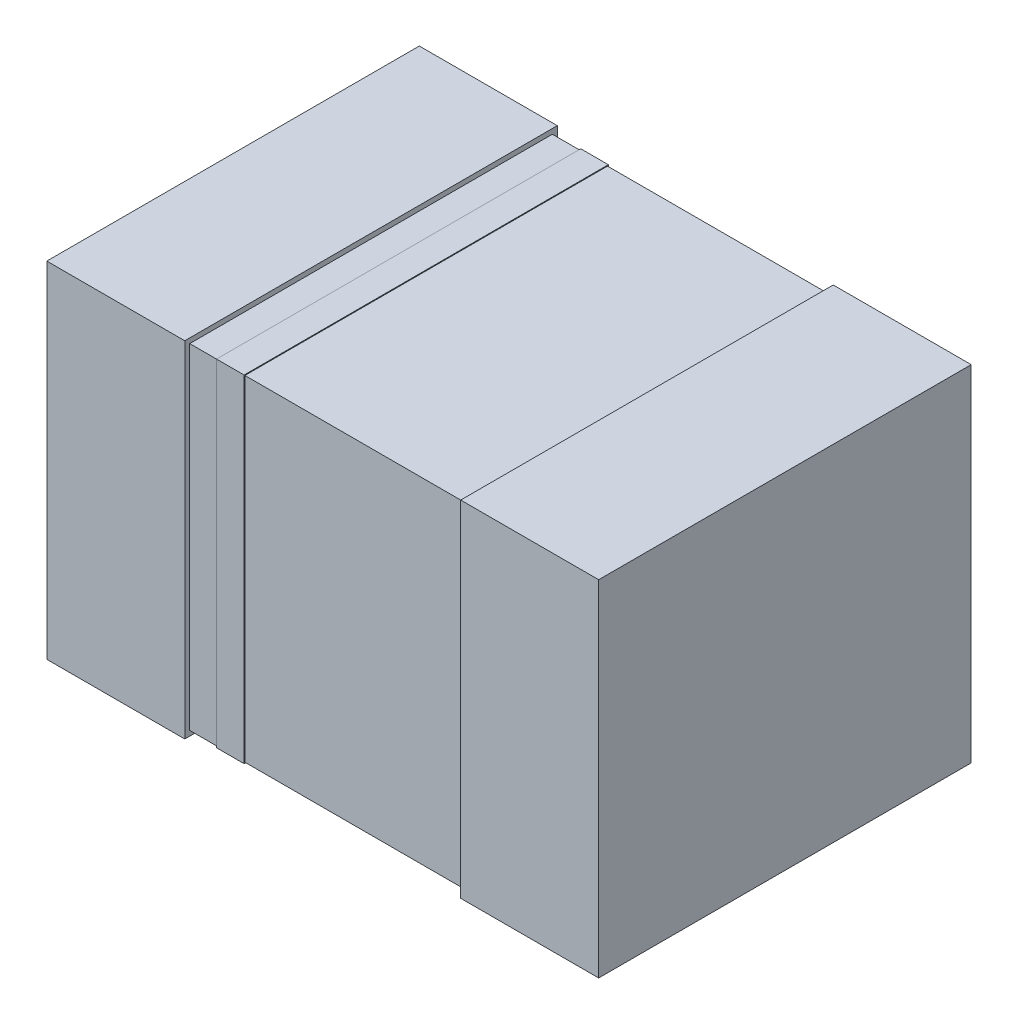
ISO-10303-21;
HEADER;
FILE_DESCRIPTION(('STEP AP214'),'2;1');
FILE_NAME('part.step','',(''),(''),'','','');
FILE_SCHEMA(('AUTOMOTIVE_DESIGN { 1 0 10303 214 1 1 1 1 }'));
ENDSEC;
DATA;
#1=APPLICATION_CONTEXT('core data for automotive mechanical design processes');
#2=APPLICATION_PROTOCOL_DEFINITION('international standard','automotive_design',2000,#1);
#3=PRODUCT_CONTEXT('',#1,'mechanical');
#4=PRODUCT('Part','Part','',(#3));
#5=PRODUCT_RELATED_PRODUCT_CATEGORY('part','',(#4));
#6=PRODUCT_DEFINITION_FORMATION('','',#4);
#7=PRODUCT_DEFINITION_CONTEXT('part definition',#1,'design');
#8=PRODUCT_DEFINITION('design','',#6,#7);
#9=PRODUCT_DEFINITION_SHAPE('','',#8);
#10=(LENGTH_UNIT() NAMED_UNIT(*) SI_UNIT(.MILLI.,.METRE.));
#11=(NAMED_UNIT(*) PLANE_ANGLE_UNIT() SI_UNIT($,.RADIAN.));
#12=(NAMED_UNIT(*) SI_UNIT($,.STERADIAN.) SOLID_ANGLE_UNIT());
#13=UNCERTAINTY_MEASURE_WITH_UNIT(LENGTH_MEASURE(1.E-05),#10,'distance_accuracy_value','');
#14=(GEOMETRIC_REPRESENTATION_CONTEXT(3) GLOBAL_UNCERTAINTY_ASSIGNED_CONTEXT((#13)) GLOBAL_UNIT_ASSIGNED_CONTEXT((#10,
#11,#12)) REPRESENTATION_CONTEXT('',''));
#15=CARTESIAN_POINT('',(0.,0.,0.));
#16=DIRECTION('',(0.,0.,1.));
#17=DIRECTION('',(1.,0.,0.));
#18=AXIS2_PLACEMENT_3D('',#15,#16,#17);
#19=CARTESIAN_POINT('',(-0.3,0.61,0.015));
#20=DIRECTION('',(0.,1.,0.));
#21=DIRECTION('',(0.,0.,1.));
#22=AXIS2_PLACEMENT_3D('',#19,#20,#21);
#23=PLANE('',#22);
#24=DIRECTION('',(1.,0.,0.));
#25=VECTOR('',#24,1.);
#26=CARTESIAN_POINT('',(-0.3,0.61,1.335));
#27=LINE('',#26,#25);
#28=CARTESIAN_POINT('',(-0.4,0.61,1.335));
#29=VERTEX_POINT('',#28);
#30=CARTESIAN_POINT('',(-0.3,0.61,1.335));
#31=VERTEX_POINT('',#30);
#32=EDGE_CURVE('P0_E126',#29,#31,#27,.T.);
#33=ORIENTED_EDGE('',*,*,#32,.T.);
#34=DIRECTION('',(0.,0.,-1.));
#35=VECTOR('',#34,1.);
#36=CARTESIAN_POINT('',(-0.3,0.61,0.015));
#37=LINE('',#36,#35);
#38=CARTESIAN_POINT('',(-0.3,0.61,0.015));
#39=VERTEX_POINT('',#38);
#40=EDGE_CURVE('P0_E119',#39,#31,#37,.F.);
#41=ORIENTED_EDGE('',*,*,#40,.F.);
#42=DIRECTION('',(1.,0.,0.));
#43=VECTOR('',#42,1.);
#44=CARTESIAN_POINT('',(-0.3,0.61,0.015));
#45=LINE('',#44,#43);
#46=CARTESIAN_POINT('',(-0.4,0.61,0.015));
#47=VERTEX_POINT('',#46);
#48=EDGE_CURVE('P0_E20',#39,#47,#45,.F.);
#49=ORIENTED_EDGE('',*,*,#48,.T.);
#50=DIRECTION('',(0.,0.,1.));
#51=VECTOR('',#50,1.);
#52=CARTESIAN_POINT('',(-0.4,0.61,0.015));
#53=LINE('',#52,#51);
#54=EDGE_CURVE('P0_E122',#29,#47,#53,.F.);
#55=ORIENTED_EDGE('',*,*,#54,.F.);
#56=EDGE_LOOP('',(#33,#41,#49,#55));
#57=FACE_BOUND('',#56,.T.);
#58=ADVANCED_FACE('P0_F17',(#57),#23,.T.);
#59=CARTESIAN_POINT('',(-0.4,0.607,0.018));
#60=DIRECTION('',(0.,-1.,0.));
#61=DIRECTION('',(0.,0.,-1.));
#62=AXIS2_PLACEMENT_3D('',#59,#60,#61);
#63=PLANE('',#62);
#64=DIRECTION('',(-1.,0.,0.));
#65=VECTOR('',#64,1.);
#66=CARTESIAN_POINT('',(-0.3,0.607,1.332));
#67=LINE('',#66,#65);
#68=CARTESIAN_POINT('',(-0.4,0.607,1.332));
#69=VERTEX_POINT('',#68);
#70=CARTESIAN_POINT('',(-0.3,0.607,1.332));
#71=VERTEX_POINT('',#70);
#72=EDGE_CURVE('P0_E106',#69,#71,#67,.F.);
#73=ORIENTED_EDGE('',*,*,#72,.F.);
#74=DIRECTION('',(0.,0.,1.));
#75=VECTOR('',#74,1.);
#76=CARTESIAN_POINT('',(-0.4,0.607,0.015));
#77=LINE('',#76,#75);
#78=CARTESIAN_POINT('',(-0.4,0.607,0.018));
#79=VERTEX_POINT('',#78);
#80=EDGE_CURVE('P0_E90',#79,#69,#77,.T.);
#81=ORIENTED_EDGE('',*,*,#80,.F.);
#82=DIRECTION('',(1.,0.,0.));
#83=VECTOR('',#82,1.);
#84=CARTESIAN_POINT('',(-0.4,0.607,0.018));
#85=LINE('',#84,#83);
#86=CARTESIAN_POINT('',(-0.3,0.607,0.018));
#87=VERTEX_POINT('',#86);
#88=EDGE_CURVE('P0_E79',#87,#79,#85,.F.);
#89=ORIENTED_EDGE('',*,*,#88,.F.);
#90=DIRECTION('',(0.,0.,-1.));
#91=VECTOR('',#90,1.);
#92=CARTESIAN_POINT('',(-0.3,0.607,0.015));
#93=LINE('',#92,#91);
#94=EDGE_CURVE('P0_E116',#71,#87,#93,.T.);
#95=ORIENTED_EDGE('',*,*,#94,.F.);
#96=EDGE_LOOP('',(#73,#81,#89,#95));
#97=FACE_BOUND('',#96,.T.);
#98=ADVANCED_FACE('P0_F223',(#97),#63,.T.);
#99=CARTESIAN_POINT('',(-0.4,-0.607,0.018));
#100=DIRECTION('',(0.,0.,1.));
#101=DIRECTION('',(1.,0.,0.));
#102=AXIS2_PLACEMENT_3D('',#99,#100,#101);
#103=PLANE('',#102);
#104=ORIENTED_EDGE('',*,*,#88,.T.);
#105=DIRECTION('',(0.,1.,0.));
#106=VECTOR('',#105,1.);
#107=CARTESIAN_POINT('',(-0.4,0.61,0.018));
#108=LINE('',#107,#106);
#109=CARTESIAN_POINT('',(-0.4,-0.607,0.018));
#110=VERTEX_POINT('',#109);
#111=EDGE_CURVE('P0_E82',#110,#79,#108,.T.);
#112=ORIENTED_EDGE('',*,*,#111,.F.);
#113=DIRECTION('',(1.,0.,0.));
#114=VECTOR('',#113,1.);
#115=CARTESIAN_POINT('',(-0.3,-0.607,0.018));
#116=LINE('',#115,#114);
#117=CARTESIAN_POINT('',(-0.3,-0.607,0.018));
#118=VERTEX_POINT('',#117);
#119=EDGE_CURVE('P0_E86',#118,#110,#116,.F.);
#120=ORIENTED_EDGE('',*,*,#119,.F.);
#121=DIRECTION('',(0.,1.,0.));
#122=VECTOR('',#121,1.);
#123=CARTESIAN_POINT('',(-0.3,-0.61,0.018));
#124=LINE('',#123,#122);
#125=EDGE_CURVE('P0_E111',#87,#118,#124,.F.);
#126=ORIENTED_EDGE('',*,*,#125,.F.);
#127=EDGE_LOOP('',(#104,#112,#120,#126));
#128=FACE_BOUND('',#127,.T.);
#129=ADVANCED_FACE('P0_F84',(#128),#103,.T.);
#130=CARTESIAN_POINT('',(-0.3,-0.607,1.332));
#131=DIRECTION('',(0.,0.,-1.));
#132=DIRECTION('',(-1.,0.,0.));
#133=AXIS2_PLACEMENT_3D('',#130,#131,#132);
#134=PLANE('',#133);
#135=ORIENTED_EDGE('',*,*,#72,.T.);
#136=DIRECTION('',(0.,1.,0.));
#137=VECTOR('',#136,1.);
#138=CARTESIAN_POINT('',(-0.3,-0.61,1.332));
#139=LINE('',#138,#137);
#140=CARTESIAN_POINT('',(-0.3,-0.607,1.332));
#141=VERTEX_POINT('',#140);
#142=EDGE_CURVE('P0_E139',#141,#71,#139,.T.);
#143=ORIENTED_EDGE('',*,*,#142,.F.);
#144=DIRECTION('',(1.,0.,0.));
#145=VECTOR('',#144,1.);
#146=CARTESIAN_POINT('',(-0.3,-0.607,1.332));
#147=LINE('',#146,#145);
#148=CARTESIAN_POINT('',(-0.4,-0.607,1.332));
#149=VERTEX_POINT('',#148);
#150=EDGE_CURVE('P0_E105',#149,#141,#147,.T.);
#151=ORIENTED_EDGE('',*,*,#150,.F.);
#152=DIRECTION('',(0.,1.,0.));
#153=VECTOR('',#152,1.);
#154=CARTESIAN_POINT('',(-0.4,-0.607,1.332));
#155=LINE('',#154,#153);
#156=EDGE_CURVE('P0_E97',#69,#149,#155,.F.);
#157=ORIENTED_EDGE('',*,*,#156,.F.);
#158=EDGE_LOOP('',(#135,#143,#151,#157));
#159=FACE_BOUND('',#158,.T.);
#160=ADVANCED_FACE('P0_F205',(#159),#134,.T.);
#161=CARTESIAN_POINT('',(-0.3,-0.607,0.018));
#162=DIRECTION('',(0.,1.,0.));
#163=DIRECTION('',(0.,0.,1.));
#164=AXIS2_PLACEMENT_3D('',#161,#162,#163);
#165=PLANE('',#164);
#166=ORIENTED_EDGE('',*,*,#150,.T.);
#167=DIRECTION('',(0.,0.,-1.));
#168=VECTOR('',#167,1.);
#169=CARTESIAN_POINT('',(-0.3,-0.607,0.015));
#170=LINE('',#169,#168);
#171=EDGE_CURVE('P0_E104',#118,#141,#170,.F.);
#172=ORIENTED_EDGE('',*,*,#171,.F.);
#173=ORIENTED_EDGE('',*,*,#119,.T.);
#174=DIRECTION('',(0.,0.,1.));
#175=VECTOR('',#174,1.);
#176=CARTESIAN_POINT('',(-0.4,-0.607,0.018));
#177=LINE('',#176,#175);
#178=EDGE_CURVE('P0_E94',#149,#110,#177,.F.);
#179=ORIENTED_EDGE('',*,*,#178,.F.);
#180=EDGE_LOOP('',(#166,#172,#173,#179));
#181=FACE_BOUND('',#180,.T.);
#182=ADVANCED_FACE('P0_F102',(#181),#165,.T.);
#183=CARTESIAN_POINT('',(-0.4,0.61,0.015));
#184=DIRECTION('',(0.,0.,-1.));
#185=DIRECTION('',(-1.,0.,0.));
#186=AXIS2_PLACEMENT_3D('',#183,#184,#185);
#187=PLANE('',#186);
#188=DIRECTION('',(1.,0.,0.));
#189=VECTOR('',#188,1.);
#190=CARTESIAN_POINT('',(-0.4,-0.61,0.015));
#191=LINE('',#190,#189);
#192=CARTESIAN_POINT('',(-0.4,-0.61,0.015));
#193=VERTEX_POINT('',#192);
#194=CARTESIAN_POINT('',(-0.3,-0.61,0.015));
#195=VERTEX_POINT('',#194);
#196=EDGE_CURVE('P0_E99',#193,#195,#191,.T.);
#197=ORIENTED_EDGE('',*,*,#196,.F.);
#198=DIRECTION('',(0.,1.,0.));
#199=VECTOR('',#198,1.);
#200=CARTESIAN_POINT('',(-0.4,0.61,0.015));
#201=LINE('',#200,#199);
#202=EDGE_CURVE('P0_E134',#193,#47,#201,.T.);
#203=ORIENTED_EDGE('',*,*,#202,.T.);
#204=ORIENTED_EDGE('',*,*,#48,.F.);
#205=DIRECTION('',(0.,1.,0.));
#206=VECTOR('',#205,1.);
#207=CARTESIAN_POINT('',(-0.3,0.61,0.015));
#208=LINE('',#207,#206);
#209=EDGE_CURVE('P0_E108',#39,#195,#208,.F.);
#210=ORIENTED_EDGE('',*,*,#209,.T.);
#211=EDGE_LOOP('',(#197,#203,#204,#210));
#212=FACE_BOUND('',#211,.T.);
#213=ADVANCED_FACE('P0_F136',(#212),#187,.T.);
#214=CARTESIAN_POINT('',(-0.3,-0.61,0.015));
#215=DIRECTION('',(1.,0.,0.));
#216=DIRECTION('',(0.,0.,-1.));
#217=AXIS2_PLACEMENT_3D('',#214,#215,#216);
#218=PLANE('',#217);
#219=ORIENTED_EDGE('',*,*,#142,.T.);
#220=ORIENTED_EDGE('',*,*,#94,.T.);
#221=ORIENTED_EDGE('',*,*,#125,.T.);
#222=ORIENTED_EDGE('',*,*,#171,.T.);
#223=EDGE_LOOP('',(#219,#220,#221,#222));
#224=FACE_BOUND('',#223,.T.);
#225=DIRECTION('',(0.,1.,0.));
#226=VECTOR('',#225,1.);
#227=CARTESIAN_POINT('',(-0.3,-0.61,1.335));
#228=LINE('',#227,#226);
#229=CARTESIAN_POINT('',(-0.3,-0.61,1.335));
#230=VERTEX_POINT('',#229);
#231=EDGE_CURVE('P0_E144',#230,#31,#228,.T.);
#232=ORIENTED_EDGE('',*,*,#231,.F.);
#233=DIRECTION('',(0.,0.,-1.));
#234=VECTOR('',#233,1.);
#235=CARTESIAN_POINT('',(-0.3,-0.61,0.015));
#236=LINE('',#235,#234);
#237=EDGE_CURVE('P0_E149',#195,#230,#236,.F.);
#238=ORIENTED_EDGE('',*,*,#237,.F.);
#239=ORIENTED_EDGE('',*,*,#209,.F.);
#240=ORIENTED_EDGE('',*,*,#40,.T.);
#241=EDGE_LOOP('',(#232,#238,#239,#240));
#242=FACE_BOUND('',#241,.T.);
#243=ADVANCED_FACE('P0_F158',(#224,#242),#218,.T.);
#244=CARTESIAN_POINT('',(-0.4,-0.61,1.335));
#245=DIRECTION('',(0.,0.,1.));
#246=DIRECTION('',(1.,0.,0.));
#247=AXIS2_PLACEMENT_3D('',#244,#245,#246);
#248=PLANE('',#247);
#249=ORIENTED_EDGE('',*,*,#32,.F.);
#250=DIRECTION('',(0.,1.,0.));
#251=VECTOR('',#250,1.);
#252=CARTESIAN_POINT('',(-0.4,-0.607,1.335));
#253=LINE('',#252,#251);
#254=CARTESIAN_POINT('',(-0.4,-0.61,1.335));
#255=VERTEX_POINT('',#254);
#256=EDGE_CURVE('P0_E35',#255,#29,#253,.T.);
#257=ORIENTED_EDGE('',*,*,#256,.F.);
#258=DIRECTION('',(1.,0.,0.));
#259=VECTOR('',#258,1.);
#260=CARTESIAN_POINT('',(-0.4,-0.61,1.335));
#261=LINE('',#260,#259);
#262=EDGE_CURVE('P0_E26',#230,#255,#261,.F.);
#263=ORIENTED_EDGE('',*,*,#262,.F.);
#264=ORIENTED_EDGE('',*,*,#231,.T.);
#265=EDGE_LOOP('',(#249,#257,#263,#264));
#266=FACE_BOUND('',#265,.T.);
#267=ADVANCED_FACE('P0_F156',(#266),#248,.T.);
#268=CARTESIAN_POINT('',(-0.4,-0.607,0.018));
#269=DIRECTION('',(-1.,0.,0.));
#270=DIRECTION('',(0.,0.,1.));
#271=AXIS2_PLACEMENT_3D('',#268,#269,#270);
#272=PLANE('',#271);
#273=ORIENTED_EDGE('',*,*,#178,.T.);
#274=ORIENTED_EDGE('',*,*,#111,.T.);
#275=ORIENTED_EDGE('',*,*,#80,.T.);
#276=ORIENTED_EDGE('',*,*,#156,.T.);
#277=EDGE_LOOP('',(#273,#274,#275,#276));
#278=FACE_BOUND('',#277,.T.);
#279=ORIENTED_EDGE('',*,*,#202,.F.);
#280=DIRECTION('',(0.,0.,-1.));
#281=VECTOR('',#280,1.);
#282=CARTESIAN_POINT('',(-0.4,-0.61,0.015));
#283=LINE('',#282,#281);
#284=EDGE_CURVE('P0_E11',#255,#193,#283,.T.);
#285=ORIENTED_EDGE('',*,*,#284,.F.);
#286=ORIENTED_EDGE('',*,*,#256,.T.);
#287=ORIENTED_EDGE('',*,*,#54,.T.);
#288=EDGE_LOOP('',(#279,#285,#286,#287));
#289=FACE_BOUND('',#288,.T.);
#290=ADVANCED_FACE('P0_F95',(#278,#289),#272,.T.);
#291=CARTESIAN_POINT('',(-0.4,-0.61,0.015));
#292=DIRECTION('',(0.,-1.,0.));
#293=DIRECTION('',(0.,0.,-1.));
#294=AXIS2_PLACEMENT_3D('',#291,#292,#293);
#295=PLANE('',#294);
#296=ORIENTED_EDGE('',*,*,#262,.T.);
#297=ORIENTED_EDGE('',*,*,#284,.T.);
#298=ORIENTED_EDGE('',*,*,#196,.T.);
#299=ORIENTED_EDGE('',*,*,#237,.T.);
#300=EDGE_LOOP('',(#296,#297,#298,#299));
#301=FACE_BOUND('',#300,.T.);
#302=ADVANCED_FACE('P0_F154',(#301),#295,.T.);
#303=CLOSED_SHELL('',(#58,#98,#129,#160,#182,#213,#243,#267,#290,#302));
#304=MANIFOLD_SOLID_BREP('P0_B1',#303);
#305=CARTESIAN_POINT('',(0.5,0.625,0.));
#306=DIRECTION('',(-1.,0.,0.));
#307=DIRECTION('',(0.,0.,1.));
#308=AXIS2_PLACEMENT_3D('',#305,#306,#307);
#309=PLANE('',#308);
#310=DIRECTION('',(0.,1.,0.));
#311=VECTOR('',#310,1.);
#312=CARTESIAN_POINT('',(0.5,-0.625,1.35));
#313=LINE('',#312,#311);
#314=CARTESIAN_POINT('',(0.5,0.625,1.35));
#315=VERTEX_POINT('',#314);
#316=CARTESIAN_POINT('',(0.5,-0.625,1.35));
#317=VERTEX_POINT('',#316);
#318=EDGE_CURVE('P1_E68',#315,#317,#313,.F.);
#319=ORIENTED_EDGE('',*,*,#318,.F.);
#320=DIRECTION('',(0.,0.,1.));
#321=VECTOR('',#320,1.);
#322=CARTESIAN_POINT('',(0.5,0.625,0.));
#323=LINE('',#322,#321);
#324=CARTESIAN_POINT('',(0.5,0.625,0.));
#325=VERTEX_POINT('',#324);
#326=EDGE_CURVE('P1_E55',#325,#315,#323,.T.);
#327=ORIENTED_EDGE('',*,*,#326,.F.);
#328=DIRECTION('',(0.,1.,0.));
#329=VECTOR('',#328,1.);
#330=CARTESIAN_POINT('',(0.5,0.625,0.));
#331=LINE('',#330,#329);
#332=CARTESIAN_POINT('',(0.5,-0.625,0.));
#333=VERTEX_POINT('',#332);
#334=EDGE_CURVE('P1_E20',#333,#325,#331,.T.);
#335=ORIENTED_EDGE('',*,*,#334,.F.);
#336=DIRECTION('',(0.,0.,-1.));
#337=VECTOR('',#336,1.);
#338=CARTESIAN_POINT('',(0.5,-0.625,0.));
#339=LINE('',#338,#337);
#340=EDGE_CURVE('P1_E81',#317,#333,#339,.T.);
#341=ORIENTED_EDGE('',*,*,#340,.F.);
#342=EDGE_LOOP('',(#319,#327,#335,#341));
#343=FACE_BOUND('',#342,.T.);
#344=ADVANCED_FACE('P1_F17',(#343),#309,.T.);
#345=CARTESIAN_POINT('',(0.5,0.625,0.));
#346=DIRECTION('',(0.,0.,-1.));
#347=DIRECTION('',(-1.,0.,0.));
#348=AXIS2_PLACEMENT_3D('',#345,#346,#347);
#349=PLANE('',#348);
#350=DIRECTION('',(1.,0.,0.));
#351=VECTOR('',#350,1.);
#352=CARTESIAN_POINT('',(0.5,-0.625,0.));
#353=LINE('',#352,#351);
#354=CARTESIAN_POINT('',(1.,-0.625,0.));
#355=VERTEX_POINT('',#354);
#356=EDGE_CURVE('P1_E64',#333,#355,#353,.T.);
#357=ORIENTED_EDGE('',*,*,#356,.F.);
#358=ORIENTED_EDGE('',*,*,#334,.T.);
#359=DIRECTION('',(1.,0.,0.));
#360=VECTOR('',#359,1.);
#361=CARTESIAN_POINT('',(1.,0.625,0.));
#362=LINE('',#361,#360);
#363=CARTESIAN_POINT('',(1.,0.625,0.));
#364=VERTEX_POINT('',#363);
#365=EDGE_CURVE('P1_E61',#364,#325,#362,.F.);
#366=ORIENTED_EDGE('',*,*,#365,.F.);
#367=DIRECTION('',(0.,1.,0.));
#368=VECTOR('',#367,1.);
#369=CARTESIAN_POINT('',(1.,-0.625,0.));
#370=LINE('',#369,#368);
#371=EDGE_CURVE('P1_E83',#355,#364,#370,.T.);
#372=ORIENTED_EDGE('',*,*,#371,.F.);
#373=EDGE_LOOP('',(#357,#358,#366,#372));
#374=FACE_BOUND('',#373,.T.);
#375=ADVANCED_FACE('P1_F60',(#374),#349,.T.);
#376=CARTESIAN_POINT('',(1.,0.625,0.));
#377=DIRECTION('',(0.,1.,0.));
#378=DIRECTION('',(0.,0.,1.));
#379=AXIS2_PLACEMENT_3D('',#376,#377,#378);
#380=PLANE('',#379);
#381=DIRECTION('',(1.,0.,0.));
#382=VECTOR('',#381,1.);
#383=CARTESIAN_POINT('',(0.5,0.625,1.35));
#384=LINE('',#383,#382);
#385=CARTESIAN_POINT('',(1.,0.625,1.35));
#386=VERTEX_POINT('',#385);
#387=EDGE_CURVE('P1_E70',#386,#315,#384,.F.);
#388=ORIENTED_EDGE('',*,*,#387,.F.);
#389=DIRECTION('',(0.,0.,-1.));
#390=VECTOR('',#389,1.);
#391=CARTESIAN_POINT('',(1.,0.625,0.));
#392=LINE('',#391,#390);
#393=EDGE_CURVE('P1_E74',#364,#386,#392,.F.);
#394=ORIENTED_EDGE('',*,*,#393,.F.);
#395=ORIENTED_EDGE('',*,*,#365,.T.);
#396=ORIENTED_EDGE('',*,*,#326,.T.);
#397=EDGE_LOOP('',(#388,#394,#395,#396));
#398=FACE_BOUND('',#397,.T.);
#399=ADVANCED_FACE('P1_F72',(#398),#380,.T.);
#400=CARTESIAN_POINT('',(0.5,-0.625,1.35));
#401=DIRECTION('',(0.,0.,1.));
#402=DIRECTION('',(1.,0.,0.));
#403=AXIS2_PLACEMENT_3D('',#400,#401,#402);
#404=PLANE('',#403);
#405=ORIENTED_EDGE('',*,*,#387,.T.);
#406=ORIENTED_EDGE('',*,*,#318,.T.);
#407=DIRECTION('',(1.,0.,0.));
#408=VECTOR('',#407,1.);
#409=CARTESIAN_POINT('',(0.5,-0.625,1.35));
#410=LINE('',#409,#408);
#411=CARTESIAN_POINT('',(1.,-0.625,1.35));
#412=VERTEX_POINT('',#411);
#413=EDGE_CURVE('P1_E35',#412,#317,#410,.F.);
#414=ORIENTED_EDGE('',*,*,#413,.F.);
#415=DIRECTION('',(0.,1.,0.));
#416=VECTOR('',#415,1.);
#417=CARTESIAN_POINT('',(1.,-0.625,1.35));
#418=LINE('',#417,#416);
#419=EDGE_CURVE('P1_E26',#386,#412,#418,.F.);
#420=ORIENTED_EDGE('',*,*,#419,.F.);
#421=EDGE_LOOP('',(#405,#406,#414,#420));
#422=FACE_BOUND('',#421,.T.);
#423=ADVANCED_FACE('P1_F89',(#422),#404,.T.);
#424=CARTESIAN_POINT('',(0.5,-0.625,0.));
#425=DIRECTION('',(0.,-1.,0.));
#426=DIRECTION('',(0.,0.,-1.));
#427=AXIS2_PLACEMENT_3D('',#424,#425,#426);
#428=PLANE('',#427);
#429=ORIENTED_EDGE('',*,*,#413,.T.);
#430=ORIENTED_EDGE('',*,*,#340,.T.);
#431=ORIENTED_EDGE('',*,*,#356,.T.);
#432=DIRECTION('',(0.,0.,-1.));
#433=VECTOR('',#432,1.);
#434=CARTESIAN_POINT('',(1.,-0.625,0.));
#435=LINE('',#434,#433);
#436=EDGE_CURVE('P1_E11',#412,#355,#435,.T.);
#437=ORIENTED_EDGE('',*,*,#436,.F.);
#438=EDGE_LOOP('',(#429,#430,#431,#437));
#439=FACE_BOUND('',#438,.T.);
#440=ADVANCED_FACE('P1_F91',(#439),#428,.T.);
#441=CARTESIAN_POINT('',(1.,-0.625,0.));
#442=DIRECTION('',(1.,0.,0.));
#443=DIRECTION('',(0.,0.,-1.));
#444=AXIS2_PLACEMENT_3D('',#441,#442,#443);
#445=PLANE('',#444);
#446=ORIENTED_EDGE('',*,*,#419,.T.);
#447=ORIENTED_EDGE('',*,*,#436,.T.);
#448=ORIENTED_EDGE('',*,*,#371,.T.);
#449=ORIENTED_EDGE('',*,*,#393,.T.);
#450=EDGE_LOOP('',(#446,#447,#448,#449));
#451=FACE_BOUND('',#450,.T.);
#452=ADVANCED_FACE('P1_F88',(#451),#445,.T.);
#453=CLOSED_SHELL('',(#344,#375,#399,#423,#440,#452));
#454=MANIFOLD_SOLID_BREP('P1_B1',#453);
#455=CARTESIAN_POINT('',(-1.,0.625,0.));
#456=DIRECTION('',(-1.,0.,0.));
#457=DIRECTION('',(0.,0.,1.));
#458=AXIS2_PLACEMENT_3D('',#455,#456,#457);
#459=PLANE('',#458);
#460=DIRECTION('',(0.,1.,0.));
#461=VECTOR('',#460,1.);
#462=CARTESIAN_POINT('',(-1.,-0.625,1.35));
#463=LINE('',#462,#461);
#464=CARTESIAN_POINT('',(-1.,0.625,1.35));
#465=VERTEX_POINT('',#464);
#466=CARTESIAN_POINT('',(-1.,-0.625,1.35));
#467=VERTEX_POINT('',#466);
#468=EDGE_CURVE('P2_E68',#465,#467,#463,.F.);
#469=ORIENTED_EDGE('',*,*,#468,.F.);
#470=DIRECTION('',(0.,0.,1.));
#471=VECTOR('',#470,1.);
#472=CARTESIAN_POINT('',(-1.,0.625,0.));
#473=LINE('',#472,#471);
#474=CARTESIAN_POINT('',(-1.,0.625,0.));
#475=VERTEX_POINT('',#474);
#476=EDGE_CURVE('P2_E55',#475,#465,#473,.T.);
#477=ORIENTED_EDGE('',*,*,#476,.F.);
#478=DIRECTION('',(0.,1.,0.));
#479=VECTOR('',#478,1.);
#480=CARTESIAN_POINT('',(-1.,0.625,0.));
#481=LINE('',#480,#479);
#482=CARTESIAN_POINT('',(-1.,-0.625,0.));
#483=VERTEX_POINT('',#482);
#484=EDGE_CURVE('P2_E20',#483,#475,#481,.T.);
#485=ORIENTED_EDGE('',*,*,#484,.F.);
#486=DIRECTION('',(0.,0.,-1.));
#487=VECTOR('',#486,1.);
#488=CARTESIAN_POINT('',(-1.,-0.625,0.));
#489=LINE('',#488,#487);
#490=EDGE_CURVE('P2_E81',#467,#483,#489,.T.);
#491=ORIENTED_EDGE('',*,*,#490,.F.);
#492=EDGE_LOOP('',(#469,#477,#485,#491));
#493=FACE_BOUND('',#492,.T.);
#494=ADVANCED_FACE('P2_F17',(#493),#459,.T.);
#495=CARTESIAN_POINT('',(-1.,0.625,0.));
#496=DIRECTION('',(0.,0.,-1.));
#497=DIRECTION('',(-1.,0.,0.));
#498=AXIS2_PLACEMENT_3D('',#495,#496,#497);
#499=PLANE('',#498);
#500=DIRECTION('',(1.,0.,0.));
#501=VECTOR('',#500,1.);
#502=CARTESIAN_POINT('',(-1.,-0.625,0.));
#503=LINE('',#502,#501);
#504=CARTESIAN_POINT('',(-0.5,-0.625,0.));
#505=VERTEX_POINT('',#504);
#506=EDGE_CURVE('P2_E64',#483,#505,#503,.T.);
#507=ORIENTED_EDGE('',*,*,#506,.F.);
#508=ORIENTED_EDGE('',*,*,#484,.T.);
#509=DIRECTION('',(1.,0.,0.));
#510=VECTOR('',#509,1.);
#511=CARTESIAN_POINT('',(-0.5,0.625,0.));
#512=LINE('',#511,#510);
#513=CARTESIAN_POINT('',(-0.5,0.625,0.));
#514=VERTEX_POINT('',#513);
#515=EDGE_CURVE('P2_E61',#514,#475,#512,.F.);
#516=ORIENTED_EDGE('',*,*,#515,.F.);
#517=DIRECTION('',(0.,1.,0.));
#518=VECTOR('',#517,1.);
#519=CARTESIAN_POINT('',(-0.5,-0.625,0.));
#520=LINE('',#519,#518);
#521=EDGE_CURVE('P2_E83',#505,#514,#520,.T.);
#522=ORIENTED_EDGE('',*,*,#521,.F.);
#523=EDGE_LOOP('',(#507,#508,#516,#522));
#524=FACE_BOUND('',#523,.T.);
#525=ADVANCED_FACE('P2_F60',(#524),#499,.T.);
#526=CARTESIAN_POINT('',(-0.5,0.625,0.));
#527=DIRECTION('',(0.,1.,0.));
#528=DIRECTION('',(0.,0.,1.));
#529=AXIS2_PLACEMENT_3D('',#526,#527,#528);
#530=PLANE('',#529);
#531=DIRECTION('',(1.,0.,0.));
#532=VECTOR('',#531,1.);
#533=CARTESIAN_POINT('',(-1.,0.625,1.35));
#534=LINE('',#533,#532);
#535=CARTESIAN_POINT('',(-0.5,0.625,1.35));
#536=VERTEX_POINT('',#535);
#537=EDGE_CURVE('P2_E70',#536,#465,#534,.F.);
#538=ORIENTED_EDGE('',*,*,#537,.F.);
#539=DIRECTION('',(0.,0.,-1.));
#540=VECTOR('',#539,1.);
#541=CARTESIAN_POINT('',(-0.5,0.625,0.));
#542=LINE('',#541,#540);
#543=EDGE_CURVE('P2_E74',#514,#536,#542,.F.);
#544=ORIENTED_EDGE('',*,*,#543,.F.);
#545=ORIENTED_EDGE('',*,*,#515,.T.);
#546=ORIENTED_EDGE('',*,*,#476,.T.);
#547=EDGE_LOOP('',(#538,#544,#545,#546));
#548=FACE_BOUND('',#547,.T.);
#549=ADVANCED_FACE('P2_F72',(#548),#530,.T.);
#550=CARTESIAN_POINT('',(-1.,-0.625,1.35));
#551=DIRECTION('',(0.,0.,1.));
#552=DIRECTION('',(1.,0.,0.));
#553=AXIS2_PLACEMENT_3D('',#550,#551,#552);
#554=PLANE('',#553);
#555=ORIENTED_EDGE('',*,*,#537,.T.);
#556=ORIENTED_EDGE('',*,*,#468,.T.);
#557=DIRECTION('',(1.,0.,0.));
#558=VECTOR('',#557,1.);
#559=CARTESIAN_POINT('',(-1.,-0.625,1.35));
#560=LINE('',#559,#558);
#561=CARTESIAN_POINT('',(-0.5,-0.625,1.35));
#562=VERTEX_POINT('',#561);
#563=EDGE_CURVE('P2_E35',#562,#467,#560,.F.);
#564=ORIENTED_EDGE('',*,*,#563,.F.);
#565=DIRECTION('',(0.,1.,0.));
#566=VECTOR('',#565,1.);
#567=CARTESIAN_POINT('',(-0.5,-0.625,1.35));
#568=LINE('',#567,#566);
#569=EDGE_CURVE('P2_E26',#536,#562,#568,.F.);
#570=ORIENTED_EDGE('',*,*,#569,.F.);
#571=EDGE_LOOP('',(#555,#556,#564,#570));
#572=FACE_BOUND('',#571,.T.);
#573=ADVANCED_FACE('P2_F89',(#572),#554,.T.);
#574=CARTESIAN_POINT('',(-1.,-0.625,0.));
#575=DIRECTION('',(0.,-1.,0.));
#576=DIRECTION('',(0.,0.,-1.));
#577=AXIS2_PLACEMENT_3D('',#574,#575,#576);
#578=PLANE('',#577);
#579=ORIENTED_EDGE('',*,*,#563,.T.);
#580=ORIENTED_EDGE('',*,*,#490,.T.);
#581=ORIENTED_EDGE('',*,*,#506,.T.);
#582=DIRECTION('',(0.,0.,-1.));
#583=VECTOR('',#582,1.);
#584=CARTESIAN_POINT('',(-0.5,-0.625,0.));
#585=LINE('',#584,#583);
#586=EDGE_CURVE('P2_E11',#562,#505,#585,.T.);
#587=ORIENTED_EDGE('',*,*,#586,.F.);
#588=EDGE_LOOP('',(#579,#580,#581,#587));
#589=FACE_BOUND('',#588,.T.);
#590=ADVANCED_FACE('P2_F91',(#589),#578,.T.);
#591=CARTESIAN_POINT('',(-0.5,-0.625,0.));
#592=DIRECTION('',(1.,0.,0.));
#593=DIRECTION('',(0.,0.,-1.));
#594=AXIS2_PLACEMENT_3D('',#591,#592,#593);
#595=PLANE('',#594);
#596=ORIENTED_EDGE('',*,*,#569,.T.);
#597=ORIENTED_EDGE('',*,*,#586,.T.);
#598=ORIENTED_EDGE('',*,*,#521,.T.);
#599=ORIENTED_EDGE('',*,*,#543,.T.);
#600=EDGE_LOOP('',(#596,#597,#598,#599));
#601=FACE_BOUND('',#600,.T.);
#602=ADVANCED_FACE('P2_F88',(#601),#595,.T.);
#603=CLOSED_SHELL('',(#494,#525,#549,#573,#590,#602));
#604=MANIFOLD_SOLID_BREP('P2_B1',#603);
#605=CARTESIAN_POINT('',(-0.5,0.607,0.018));
#606=DIRECTION('',(-1.,0.,0.));
#607=DIRECTION('',(0.,0.,1.));
#608=AXIS2_PLACEMENT_3D('',#605,#606,#607);
#609=PLANE('',#608);
#610=DIRECTION('',(0.,1.,0.));
#611=VECTOR('',#610,1.);
#612=CARTESIAN_POINT('',(-0.5,-0.607,1.332));
#613=LINE('',#612,#611);
#614=CARTESIAN_POINT('',(-0.5,0.607,1.332));
#615=VERTEX_POINT('',#614);
#616=CARTESIAN_POINT('',(-0.5,-0.607,1.332));
#617=VERTEX_POINT('',#616);
#618=EDGE_CURVE('P3_E68',#615,#617,#613,.F.);
#619=ORIENTED_EDGE('',*,*,#618,.F.);
#620=DIRECTION('',(0.,0.,1.));
#621=VECTOR('',#620,1.);
#622=CARTESIAN_POINT('',(-0.5,0.607,0.018));
#623=LINE('',#622,#621);
#624=CARTESIAN_POINT('',(-0.5,0.607,0.018));
#625=VERTEX_POINT('',#624);
#626=EDGE_CURVE('P3_E55',#625,#615,#623,.T.);
#627=ORIENTED_EDGE('',*,*,#626,.F.);
#628=DIRECTION('',(0.,1.,0.));
#629=VECTOR('',#628,1.);
#630=CARTESIAN_POINT('',(-0.5,0.607,0.018));
#631=LINE('',#630,#629);
#632=CARTESIAN_POINT('',(-0.5,-0.607,0.018));
#633=VERTEX_POINT('',#632);
#634=EDGE_CURVE('P3_E20',#633,#625,#631,.T.);
#635=ORIENTED_EDGE('',*,*,#634,.F.);
#636=DIRECTION('',(0.,0.,-1.));
#637=VECTOR('',#636,1.);
#638=CARTESIAN_POINT('',(-0.5,-0.607,0.018));
#639=LINE('',#638,#637);
#640=EDGE_CURVE('P3_E81',#617,#633,#639,.T.);
#641=ORIENTED_EDGE('',*,*,#640,.F.);
#642=EDGE_LOOP('',(#619,#627,#635,#641));
#643=FACE_BOUND('',#642,.T.);
#644=ADVANCED_FACE('P3_F17',(#643),#609,.T.);
#645=CARTESIAN_POINT('',(-0.5,0.607,0.018));
#646=DIRECTION('',(0.,0.,-1.));
#647=DIRECTION('',(-1.,0.,0.));
#648=AXIS2_PLACEMENT_3D('',#645,#646,#647);
#649=PLANE('',#648);
#650=DIRECTION('',(1.,0.,0.));
#651=VECTOR('',#650,1.);
#652=CARTESIAN_POINT('',(-0.5,-0.607,0.018));
#653=LINE('',#652,#651);
#654=CARTESIAN_POINT('',(0.5,-0.607,0.018));
#655=VERTEX_POINT('',#654);
#656=EDGE_CURVE('P3_E64',#633,#655,#653,.T.);
#657=ORIENTED_EDGE('',*,*,#656,.F.);
#658=ORIENTED_EDGE('',*,*,#634,.T.);
#659=DIRECTION('',(1.,0.,0.));
#660=VECTOR('',#659,1.);
#661=CARTESIAN_POINT('',(0.5,0.607,0.018));
#662=LINE('',#661,#660);
#663=CARTESIAN_POINT('',(0.5,0.607,0.018));
#664=VERTEX_POINT('',#663);
#665=EDGE_CURVE('P3_E61',#664,#625,#662,.F.);
#666=ORIENTED_EDGE('',*,*,#665,.F.);
#667=DIRECTION('',(0.,1.,0.));
#668=VECTOR('',#667,1.);
#669=CARTESIAN_POINT('',(0.5,-0.607,0.018));
#670=LINE('',#669,#668);
#671=EDGE_CURVE('P3_E83',#655,#664,#670,.T.);
#672=ORIENTED_EDGE('',*,*,#671,.F.);
#673=EDGE_LOOP('',(#657,#658,#666,#672));
#674=FACE_BOUND('',#673,.T.);
#675=ADVANCED_FACE('P3_F60',(#674),#649,.T.);
#676=CARTESIAN_POINT('',(0.5,0.607,0.018));
#677=DIRECTION('',(0.,1.,0.));
#678=DIRECTION('',(0.,0.,1.));
#679=AXIS2_PLACEMENT_3D('',#676,#677,#678);
#680=PLANE('',#679);
#681=DIRECTION('',(1.,0.,0.));
#682=VECTOR('',#681,1.);
#683=CARTESIAN_POINT('',(-0.5,0.607,1.332));
#684=LINE('',#683,#682);
#685=CARTESIAN_POINT('',(0.5,0.607,1.332));
#686=VERTEX_POINT('',#685);
#687=EDGE_CURVE('P3_E70',#686,#615,#684,.F.);
#688=ORIENTED_EDGE('',*,*,#687,.F.);
#689=DIRECTION('',(0.,0.,-1.));
#690=VECTOR('',#689,1.);
#691=CARTESIAN_POINT('',(0.5,0.607,0.018));
#692=LINE('',#691,#690);
#693=EDGE_CURVE('P3_E74',#664,#686,#692,.F.);
#694=ORIENTED_EDGE('',*,*,#693,.F.);
#695=ORIENTED_EDGE('',*,*,#665,.T.);
#696=ORIENTED_EDGE('',*,*,#626,.T.);
#697=EDGE_LOOP('',(#688,#694,#695,#696));
#698=FACE_BOUND('',#697,.T.);
#699=ADVANCED_FACE('P3_F72',(#698),#680,.T.);
#700=CARTESIAN_POINT('',(-0.5,-0.607,1.332));
#701=DIRECTION('',(0.,0.,1.));
#702=DIRECTION('',(1.,0.,0.));
#703=AXIS2_PLACEMENT_3D('',#700,#701,#702);
#704=PLANE('',#703);
#705=ORIENTED_EDGE('',*,*,#687,.T.);
#706=ORIENTED_EDGE('',*,*,#618,.T.);
#707=DIRECTION('',(1.,0.,0.));
#708=VECTOR('',#707,1.);
#709=CARTESIAN_POINT('',(-0.5,-0.607,1.332));
#710=LINE('',#709,#708);
#711=CARTESIAN_POINT('',(0.5,-0.607,1.332));
#712=VERTEX_POINT('',#711);
#713=EDGE_CURVE('P3_E35',#712,#617,#710,.F.);
#714=ORIENTED_EDGE('',*,*,#713,.F.);
#715=DIRECTION('',(0.,1.,0.));
#716=VECTOR('',#715,1.);
#717=CARTESIAN_POINT('',(0.5,-0.607,1.332));
#718=LINE('',#717,#716);
#719=EDGE_CURVE('P3_E26',#686,#712,#718,.F.);
#720=ORIENTED_EDGE('',*,*,#719,.F.);
#721=EDGE_LOOP('',(#705,#706,#714,#720));
#722=FACE_BOUND('',#721,.T.);
#723=ADVANCED_FACE('P3_F89',(#722),#704,.T.);
#724=CARTESIAN_POINT('',(-0.5,-0.607,0.018));
#725=DIRECTION('',(0.,-1.,0.));
#726=DIRECTION('',(0.,0.,-1.));
#727=AXIS2_PLACEMENT_3D('',#724,#725,#726);
#728=PLANE('',#727);
#729=ORIENTED_EDGE('',*,*,#713,.T.);
#730=ORIENTED_EDGE('',*,*,#640,.T.);
#731=ORIENTED_EDGE('',*,*,#656,.T.);
#732=DIRECTION('',(0.,0.,-1.));
#733=VECTOR('',#732,1.);
#734=CARTESIAN_POINT('',(0.5,-0.607,0.018));
#735=LINE('',#734,#733);
#736=EDGE_CURVE('P3_E11',#712,#655,#735,.T.);
#737=ORIENTED_EDGE('',*,*,#736,.F.);
#738=EDGE_LOOP('',(#729,#730,#731,#737));
#739=FACE_BOUND('',#738,.T.);
#740=ADVANCED_FACE('P3_F91',(#739),#728,.T.);
#741=CARTESIAN_POINT('',(0.5,-0.607,0.018));
#742=DIRECTION('',(1.,0.,0.));
#743=DIRECTION('',(0.,0.,-1.));
#744=AXIS2_PLACEMENT_3D('',#741,#742,#743);
#745=PLANE('',#744);
#746=ORIENTED_EDGE('',*,*,#719,.T.);
#747=ORIENTED_EDGE('',*,*,#736,.T.);
#748=ORIENTED_EDGE('',*,*,#671,.T.);
#749=ORIENTED_EDGE('',*,*,#693,.T.);
#750=EDGE_LOOP('',(#746,#747,#748,#749));
#751=FACE_BOUND('',#750,.T.);
#752=ADVANCED_FACE('P3_F88',(#751),#745,.T.);
#753=CLOSED_SHELL('',(#644,#675,#699,#723,#740,#752));
#754=MANIFOLD_SOLID_BREP('P3_B1',#753);
#755=ADVANCED_BREP_SHAPE_REPRESENTATION('',(#18,#304,#454,#604,#754),#14);
#756=SHAPE_DEFINITION_REPRESENTATION(#9,#755);
ENDSEC;
END-ISO-10303-21;
